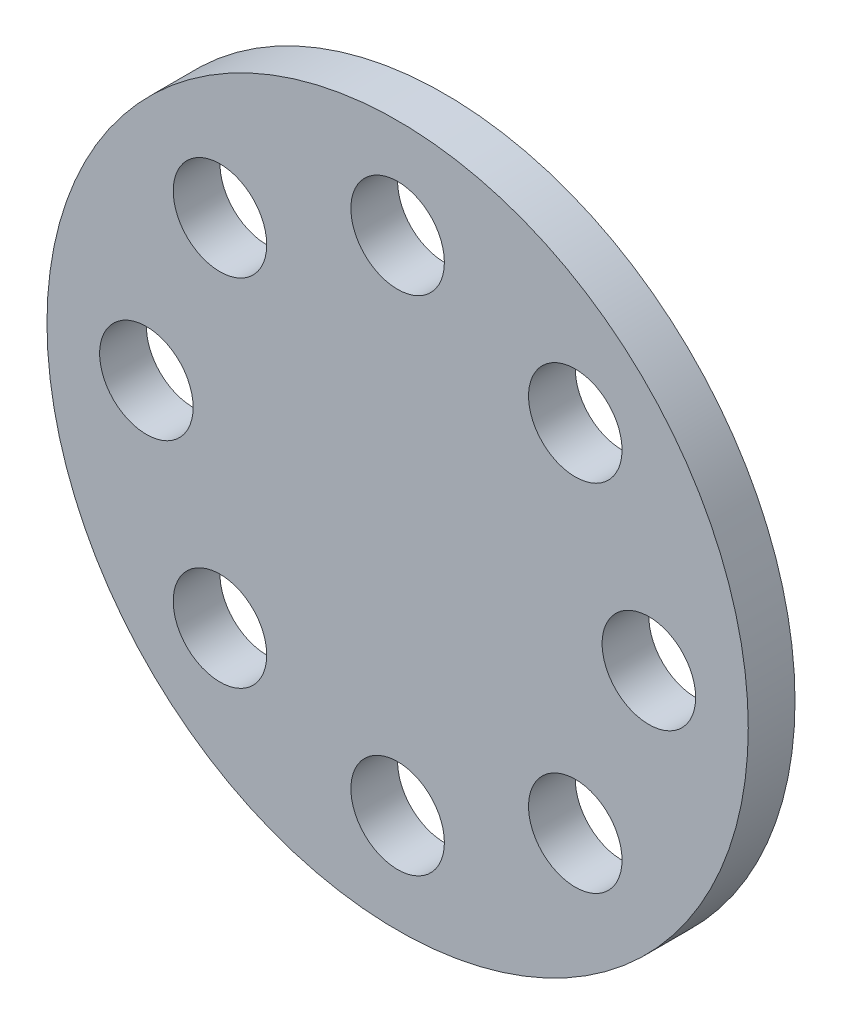
ISO-10303-21;
HEADER;
FILE_DESCRIPTION(('STEP AP214'),'2;1');
FILE_NAME('part.step','',(''),(''),'','','');
FILE_SCHEMA(('AUTOMOTIVE_DESIGN { 1 0 10303 214 1 1 1 1 }'));
ENDSEC;
DATA;
#1=APPLICATION_CONTEXT('core data for automotive mechanical design processes');
#2=APPLICATION_PROTOCOL_DEFINITION('international standard','automotive_design',2000,#1);
#3=PRODUCT_CONTEXT('',#1,'mechanical');
#4=PRODUCT('Part','Part','',(#3));
#5=PRODUCT_RELATED_PRODUCT_CATEGORY('part','',(#4));
#6=PRODUCT_DEFINITION_FORMATION('','',#4);
#7=PRODUCT_DEFINITION_CONTEXT('part definition',#1,'design');
#8=PRODUCT_DEFINITION('design','',#6,#7);
#9=PRODUCT_DEFINITION_SHAPE('','',#8);
#10=(LENGTH_UNIT() NAMED_UNIT(*) SI_UNIT(.MILLI.,.METRE.));
#11=(NAMED_UNIT(*) PLANE_ANGLE_UNIT() SI_UNIT($,.RADIAN.));
#12=(NAMED_UNIT(*) SI_UNIT($,.STERADIAN.) SOLID_ANGLE_UNIT());
#13=UNCERTAINTY_MEASURE_WITH_UNIT(LENGTH_MEASURE(1.E-05),#10,'distance_accuracy_value','');
#14=(GEOMETRIC_REPRESENTATION_CONTEXT(3) GLOBAL_UNCERTAINTY_ASSIGNED_CONTEXT((#13)) GLOBAL_UNIT_ASSIGNED_CONTEXT((#10,
#11,#12)) REPRESENTATION_CONTEXT('',''));
#15=CARTESIAN_POINT('',(0.,0.,0.));
#16=DIRECTION('',(0.,0.,1.));
#17=DIRECTION('',(1.,0.,0.));
#18=AXIS2_PLACEMENT_3D('',#15,#16,#17);
#19=CARTESIAN_POINT('',(0.,0.,10.));
#20=DIRECTION('',(0.,0.,1.));
#21=DIRECTION('',(1.,0.,0.));
#22=AXIS2_PLACEMENT_3D('',#19,#20,#21);
#23=PLANE('',#22);
#24=CARTESIAN_POINT('',(-53.737864077666,-3.91047202279254E-12,10.));
#25=DIRECTION('',(0.,0.,1.));
#26=DIRECTION('',(1.,0.,0.));
#27=AXIS2_PLACEMENT_3D('',#24,#25,#26);
#28=CIRCLE('',#27,10.0000000000054);
#29=CARTESIAN_POINT('',(-43.7378640776606,-3.91047202279254E-12,10.));
#30=VERTEX_POINT('',#29);
#31=EDGE_CURVE('E77',#30,#30,#28,.T.);
#32=ORIENTED_EDGE('',*,*,#31,.F.);
#33=EDGE_LOOP('',(#32));
#34=FACE_BOUND('',#33,.T.);
#35=CARTESIAN_POINT('',(7.80778206493794E-12,-53.7378640776699,10.));
#36=DIRECTION('',(0.,0.,1.));
#37=DIRECTION('',(1.,0.,0.));
#38=AXIS2_PLACEMENT_3D('',#35,#36,#37);
#39=CIRCLE('',#38,10.0000000000078);
#40=CARTESIAN_POINT('',(10.0000000000156,-53.7378640776699,10.));
#41=VERTEX_POINT('',#40);
#42=EDGE_CURVE('E65',#41,#41,#39,.T.);
#43=ORIENTED_EDGE('',*,*,#42,.F.);
#44=EDGE_LOOP('',(#43));
#45=FACE_BOUND('',#44,.T.);
#46=CARTESIAN_POINT('',(53.7378640776738,3.90389103246897E-12,10.));
#47=DIRECTION('',(0.,0.,1.));
#48=DIRECTION('',(1.,0.,0.));
#49=AXIS2_PLACEMENT_3D('',#46,#47,#48);
#50=CIRCLE('',#49,10.0000000000028);
#51=CARTESIAN_POINT('',(63.7378640776766,3.90389103246897E-12,10.));
#52=VERTEX_POINT('',#51);
#53=EDGE_CURVE('E53',#52,#52,#50,.T.);
#54=ORIENTED_EDGE('',*,*,#53,.F.);
#55=EDGE_LOOP('',(#54));
#56=FACE_BOUND('',#55,.T.);
#57=CARTESIAN_POINT('',(0.,53.7378640776699,10.));
#58=DIRECTION('',(0.,0.,1.));
#59=DIRECTION('',(1.,0.,0.));
#60=AXIS2_PLACEMENT_3D('',#57,#58,#59);
#61=CIRCLE('',#60,10.);
#62=CARTESIAN_POINT('',(10.,53.7378640776699,10.));
#63=VERTEX_POINT('',#62);
#64=EDGE_CURVE('E42',#63,#63,#61,.T.);
#65=ORIENTED_EDGE('',*,*,#64,.F.);
#66=EDGE_LOOP('',(#65));
#67=FACE_BOUND('',#66,.T.);
#68=CARTESIAN_POINT('',(0.,0.,10.));
#69=DIRECTION('',(0.,0.,1.));
#70=DIRECTION('',(1.,0.,0.));
#71=AXIS2_PLACEMENT_3D('',#68,#69,#70);
#72=CIRCLE('',#71,75.);
#73=CARTESIAN_POINT('',(75.,0.,10.));
#74=VERTEX_POINT('',#73);
#75=EDGE_CURVE('E10',#74,#74,#72,.T.);
#76=ORIENTED_EDGE('',*,*,#75,.T.);
#77=EDGE_LOOP('',(#76));
#78=FACE_BOUND('',#77,.T.);
#79=CARTESIAN_POINT('',(37.9984080958025,37.9984080958041,10.));
#80=DIRECTION('',(0.,0.,1.));
#81=DIRECTION('',(1.,0.,0.));
#82=AXIS2_PLACEMENT_3D('',#79,#80,#81);
#83=CIRCLE('',#82,10.0000000000004);
#84=CARTESIAN_POINT('',(47.9984080958029,37.9984080958041,10.));
#85=VERTEX_POINT('',#84);
#86=EDGE_CURVE('E47',#85,#85,#83,.T.);
#87=ORIENTED_EDGE('',*,*,#86,.F.);
#88=EDGE_LOOP('',(#87));
#89=FACE_BOUND('',#88,.T.);
#90=CARTESIAN_POINT('',(37.998408095808,-37.9984080957986,10.));
#91=DIRECTION('',(0.,0.,1.));
#92=DIRECTION('',(1.,0.,0.));
#93=AXIS2_PLACEMENT_3D('',#90,#91,#92);
#94=CIRCLE('',#93,10.0000000000058);
#95=CARTESIAN_POINT('',(47.9984080958139,-37.9984080957986,10.));
#96=VERTEX_POINT('',#95);
#97=EDGE_CURVE('E59',#96,#96,#94,.T.);
#98=ORIENTED_EDGE('',*,*,#97,.F.);
#99=EDGE_LOOP('',(#98));
#100=FACE_BOUND('',#99,.T.);
#101=CARTESIAN_POINT('',(-37.9984080957947,-37.9984080958041,10.));
#102=DIRECTION('',(0.,0.,1.));
#103=DIRECTION('',(1.,0.,0.));
#104=AXIS2_PLACEMENT_3D('',#101,#102,#103);
#105=CIRCLE('',#104,10.0000000000076);
#106=CARTESIAN_POINT('',(-27.9984080957871,-37.9984080958041,10.));
#107=VERTEX_POINT('',#106);
#108=EDGE_CURVE('E71',#107,#107,#105,.T.);
#109=ORIENTED_EDGE('',*,*,#108,.F.);
#110=EDGE_LOOP('',(#109));
#111=FACE_BOUND('',#110,.T.);
#112=CARTESIAN_POINT('',(-37.9984080958002,37.9984080957986,10.));
#113=DIRECTION('',(0.,0.,1.));
#114=DIRECTION('',(1.,0.,0.));
#115=AXIS2_PLACEMENT_3D('',#112,#113,#114);
#116=CIRCLE('',#115,10.0000000000025);
#117=CARTESIAN_POINT('',(-27.9984080957977,37.9984080957986,10.));
#118=VERTEX_POINT('',#117);
#119=EDGE_CURVE('E83',#118,#118,#116,.T.);
#120=ORIENTED_EDGE('',*,*,#119,.F.);
#121=EDGE_LOOP('',(#120));
#122=FACE_BOUND('',#121,.T.);
#123=ADVANCED_FACE('F31',(#34,#45,#56,#67,#78,#89,#100,#111,#122),#23,.T.);
#124=CARTESIAN_POINT('',(0.,0.,0.));
#125=DIRECTION('',(0.,0.,1.));
#126=DIRECTION('',(1.,0.,0.));
#127=AXIS2_PLACEMENT_3D('',#124,#125,#126);
#128=PLANE('',#127);
#129=CARTESIAN_POINT('',(0.,0.,0.));
#130=DIRECTION('',(0.,0.,1.));
#131=DIRECTION('',(1.,0.,0.));
#132=AXIS2_PLACEMENT_3D('',#129,#130,#131);
#133=CIRCLE('',#132,75.);
#134=CARTESIAN_POINT('',(75.,0.,0.));
#135=VERTEX_POINT('',#134);
#136=EDGE_CURVE('E35',#135,#135,#133,.T.);
#137=ORIENTED_EDGE('',*,*,#136,.F.);
#138=EDGE_LOOP('',(#137));
#139=FACE_BOUND('',#138,.T.);
#140=CARTESIAN_POINT('',(0.,53.7378640776699,0.));
#141=DIRECTION('',(0.,0.,1.));
#142=DIRECTION('',(1.,0.,0.));
#143=AXIS2_PLACEMENT_3D('',#140,#141,#142);
#144=CIRCLE('',#143,10.);
#145=CARTESIAN_POINT('',(10.,53.7378640776699,0.));
#146=VERTEX_POINT('',#145);
#147=EDGE_CURVE('E44',#146,#146,#144,.T.);
#148=ORIENTED_EDGE('',*,*,#147,.T.);
#149=EDGE_LOOP('',(#148));
#150=FACE_BOUND('',#149,.T.);
#151=CARTESIAN_POINT('',(37.9984080958025,37.9984080958041,0.));
#152=DIRECTION('',(0.,0.,1.));
#153=DIRECTION('',(1.,0.,0.));
#154=AXIS2_PLACEMENT_3D('',#151,#152,#153);
#155=CIRCLE('',#154,10.0000000000004);
#156=CARTESIAN_POINT('',(47.9984080958029,37.9984080958041,0.));
#157=VERTEX_POINT('',#156);
#158=EDGE_CURVE('E50',#157,#157,#155,.T.);
#159=ORIENTED_EDGE('',*,*,#158,.T.);
#160=EDGE_LOOP('',(#159));
#161=FACE_BOUND('',#160,.T.);
#162=CARTESIAN_POINT('',(53.7378640776738,3.90389103246897E-12,0.));
#163=DIRECTION('',(0.,0.,1.));
#164=DIRECTION('',(1.,0.,0.));
#165=AXIS2_PLACEMENT_3D('',#162,#163,#164);
#166=CIRCLE('',#165,10.0000000000028);
#167=CARTESIAN_POINT('',(63.7378640776766,3.90389103246897E-12,0.));
#168=VERTEX_POINT('',#167);
#169=EDGE_CURVE('E56',#168,#168,#166,.T.);
#170=ORIENTED_EDGE('',*,*,#169,.T.);
#171=EDGE_LOOP('',(#170));
#172=FACE_BOUND('',#171,.T.);
#173=CARTESIAN_POINT('',(37.998408095808,-37.9984080957986,0.));
#174=DIRECTION('',(0.,0.,1.));
#175=DIRECTION('',(1.,0.,0.));
#176=AXIS2_PLACEMENT_3D('',#173,#174,#175);
#177=CIRCLE('',#176,10.0000000000058);
#178=CARTESIAN_POINT('',(47.9984080958139,-37.9984080957986,0.));
#179=VERTEX_POINT('',#178);
#180=EDGE_CURVE('E62',#179,#179,#177,.T.);
#181=ORIENTED_EDGE('',*,*,#180,.T.);
#182=EDGE_LOOP('',(#181));
#183=FACE_BOUND('',#182,.T.);
#184=CARTESIAN_POINT('',(7.80778206493794E-12,-53.7378640776699,0.));
#185=DIRECTION('',(0.,0.,1.));
#186=DIRECTION('',(1.,0.,0.));
#187=AXIS2_PLACEMENT_3D('',#184,#185,#186);
#188=CIRCLE('',#187,10.0000000000078);
#189=CARTESIAN_POINT('',(10.0000000000156,-53.7378640776699,0.));
#190=VERTEX_POINT('',#189);
#191=EDGE_CURVE('E68',#190,#190,#188,.T.);
#192=ORIENTED_EDGE('',*,*,#191,.T.);
#193=EDGE_LOOP('',(#192));
#194=FACE_BOUND('',#193,.T.);
#195=CARTESIAN_POINT('',(-37.9984080957947,-37.9984080958041,0.));
#196=DIRECTION('',(0.,0.,1.));
#197=DIRECTION('',(1.,0.,0.));
#198=AXIS2_PLACEMENT_3D('',#195,#196,#197);
#199=CIRCLE('',#198,10.0000000000076);
#200=CARTESIAN_POINT('',(-27.9984080957871,-37.9984080958041,0.));
#201=VERTEX_POINT('',#200);
#202=EDGE_CURVE('E74',#201,#201,#199,.T.);
#203=ORIENTED_EDGE('',*,*,#202,.T.);
#204=EDGE_LOOP('',(#203));
#205=FACE_BOUND('',#204,.T.);
#206=CARTESIAN_POINT('',(-53.737864077666,-3.91047202279254E-12,0.));
#207=DIRECTION('',(0.,0.,1.));
#208=DIRECTION('',(1.,0.,0.));
#209=AXIS2_PLACEMENT_3D('',#206,#207,#208);
#210=CIRCLE('',#209,10.0000000000054);
#211=CARTESIAN_POINT('',(-43.7378640776606,-3.91047202279254E-12,0.));
#212=VERTEX_POINT('',#211);
#213=EDGE_CURVE('E80',#212,#212,#210,.T.);
#214=ORIENTED_EDGE('',*,*,#213,.T.);
#215=EDGE_LOOP('',(#214));
#216=FACE_BOUND('',#215,.T.);
#217=CARTESIAN_POINT('',(-37.9984080958002,37.9984080957986,0.));
#218=DIRECTION('',(0.,0.,1.));
#219=DIRECTION('',(1.,0.,0.));
#220=AXIS2_PLACEMENT_3D('',#217,#218,#219);
#221=CIRCLE('',#220,10.0000000000025);
#222=CARTESIAN_POINT('',(-27.9984080957977,37.9984080957986,0.));
#223=VERTEX_POINT('',#222);
#224=EDGE_CURVE('E86',#223,#223,#221,.T.);
#225=ORIENTED_EDGE('',*,*,#224,.T.);
#226=EDGE_LOOP('',(#225));
#227=FACE_BOUND('',#226,.T.);
#228=ADVANCED_FACE('F96',(#139,#150,#161,#172,#183,#194,#205,#216,#227),#128,.F.);
#229=CARTESIAN_POINT('',(0.,0.,10.));
#230=DIRECTION('',(0.,0.,-1.));
#231=DIRECTION('',(-1.,0.,0.));
#232=AXIS2_PLACEMENT_3D('',#229,#230,#231);
#233=CYLINDRICAL_SURFACE('',#232,75.);
#234=ORIENTED_EDGE('',*,*,#75,.F.);
#235=EDGE_LOOP('',(#234));
#236=FACE_BOUND('',#235,.T.);
#237=ORIENTED_EDGE('',*,*,#136,.T.);
#238=EDGE_LOOP('',(#237));
#239=FACE_BOUND('',#238,.T.);
#240=ADVANCED_FACE('F33',(#236,#239),#233,.T.);
#241=CARTESIAN_POINT('',(0.,53.7378640776699,10.));
#242=DIRECTION('',(0.,0.,-1.));
#243=DIRECTION('',(-1.,0.,0.));
#244=AXIS2_PLACEMENT_3D('',#241,#242,#243);
#245=CYLINDRICAL_SURFACE('',#244,10.);
#246=ORIENTED_EDGE('',*,*,#64,.T.);
#247=EDGE_LOOP('',(#246));
#248=FACE_BOUND('',#247,.T.);
#249=ORIENTED_EDGE('',*,*,#147,.F.);
#250=EDGE_LOOP('',(#249));
#251=FACE_BOUND('',#250,.T.);
#252=ADVANCED_FACE('F106',(#248,#251),#245,.F.);
#253=CARTESIAN_POINT('',(37.9984080958025,37.9984080958041,10.));
#254=DIRECTION('',(0.,0.,-1.));
#255=DIRECTION('',(-1.,0.,0.));
#256=AXIS2_PLACEMENT_3D('',#253,#254,#255);
#257=CYLINDRICAL_SURFACE('',#256,10.0000000000004);
#258=ORIENTED_EDGE('',*,*,#86,.T.);
#259=EDGE_LOOP('',(#258));
#260=FACE_BOUND('',#259,.T.);
#261=ORIENTED_EDGE('',*,*,#158,.F.);
#262=EDGE_LOOP('',(#261));
#263=FACE_BOUND('',#262,.T.);
#264=ADVANCED_FACE('F109',(#260,#263),#257,.F.);
#265=CARTESIAN_POINT('',(53.7378640776738,3.90389103246897E-12,10.));
#266=DIRECTION('',(0.,0.,-1.));
#267=DIRECTION('',(-1.,0.,0.));
#268=AXIS2_PLACEMENT_3D('',#265,#266,#267);
#269=CYLINDRICAL_SURFACE('',#268,10.0000000000028);
#270=ORIENTED_EDGE('',*,*,#53,.T.);
#271=EDGE_LOOP('',(#270));
#272=FACE_BOUND('',#271,.T.);
#273=ORIENTED_EDGE('',*,*,#169,.F.);
#274=EDGE_LOOP('',(#273));
#275=FACE_BOUND('',#274,.T.);
#276=ADVANCED_FACE('F113',(#272,#275),#269,.F.);
#277=CARTESIAN_POINT('',(37.998408095808,-37.9984080957986,10.));
#278=DIRECTION('',(0.,0.,-1.));
#279=DIRECTION('',(-1.,0.,0.));
#280=AXIS2_PLACEMENT_3D('',#277,#278,#279);
#281=CYLINDRICAL_SURFACE('',#280,10.0000000000058);
#282=ORIENTED_EDGE('',*,*,#97,.T.);
#283=EDGE_LOOP('',(#282));
#284=FACE_BOUND('',#283,.T.);
#285=ORIENTED_EDGE('',*,*,#180,.F.);
#286=EDGE_LOOP('',(#285));
#287=FACE_BOUND('',#286,.T.);
#288=ADVANCED_FACE('F117',(#284,#287),#281,.F.);
#289=CARTESIAN_POINT('',(7.80778206493794E-12,-53.7378640776699,10.));
#290=DIRECTION('',(0.,0.,-1.));
#291=DIRECTION('',(-1.,0.,0.));
#292=AXIS2_PLACEMENT_3D('',#289,#290,#291);
#293=CYLINDRICAL_SURFACE('',#292,10.0000000000078);
#294=ORIENTED_EDGE('',*,*,#42,.T.);
#295=EDGE_LOOP('',(#294));
#296=FACE_BOUND('',#295,.T.);
#297=ORIENTED_EDGE('',*,*,#191,.F.);
#298=EDGE_LOOP('',(#297));
#299=FACE_BOUND('',#298,.T.);
#300=ADVANCED_FACE('F121',(#296,#299),#293,.F.);
#301=CARTESIAN_POINT('',(-37.9984080957947,-37.9984080958041,10.));
#302=DIRECTION('',(0.,0.,-1.));
#303=DIRECTION('',(-1.,0.,0.));
#304=AXIS2_PLACEMENT_3D('',#301,#302,#303);
#305=CYLINDRICAL_SURFACE('',#304,10.0000000000076);
#306=ORIENTED_EDGE('',*,*,#108,.T.);
#307=EDGE_LOOP('',(#306));
#308=FACE_BOUND('',#307,.T.);
#309=ORIENTED_EDGE('',*,*,#202,.F.);
#310=EDGE_LOOP('',(#309));
#311=FACE_BOUND('',#310,.T.);
#312=ADVANCED_FACE('F125',(#308,#311),#305,.F.);
#313=CARTESIAN_POINT('',(-53.737864077666,-3.91047202279254E-12,10.));
#314=DIRECTION('',(0.,0.,-1.));
#315=DIRECTION('',(-1.,0.,0.));
#316=AXIS2_PLACEMENT_3D('',#313,#314,#315);
#317=CYLINDRICAL_SURFACE('',#316,10.0000000000054);
#318=ORIENTED_EDGE('',*,*,#31,.T.);
#319=EDGE_LOOP('',(#318));
#320=FACE_BOUND('',#319,.T.);
#321=ORIENTED_EDGE('',*,*,#213,.F.);
#322=EDGE_LOOP('',(#321));
#323=FACE_BOUND('',#322,.T.);
#324=ADVANCED_FACE('F129',(#320,#323),#317,.F.);
#325=CARTESIAN_POINT('',(-37.9984080958002,37.9984080957986,10.));
#326=DIRECTION('',(0.,0.,-1.));
#327=DIRECTION('',(-1.,0.,0.));
#328=AXIS2_PLACEMENT_3D('',#325,#326,#327);
#329=CYLINDRICAL_SURFACE('',#328,10.0000000000025);
#330=ORIENTED_EDGE('',*,*,#119,.T.);
#331=EDGE_LOOP('',(#330));
#332=FACE_BOUND('',#331,.T.);
#333=ORIENTED_EDGE('',*,*,#224,.F.);
#334=EDGE_LOOP('',(#333));
#335=FACE_BOUND('',#334,.T.);
#336=ADVANCED_FACE('F92',(#332,#335),#329,.F.);
#337=CLOSED_SHELL('',(#123,#228,#240,#252,#264,#276,#288,#300,#312,#324,#336));
#338=MANIFOLD_SOLID_BREP('B2',#337);
#339=ADVANCED_BREP_SHAPE_REPRESENTATION('',(#18,#338),#14);
#340=SHAPE_DEFINITION_REPRESENTATION(#9,#339);
ENDSEC;
END-ISO-10303-21;
